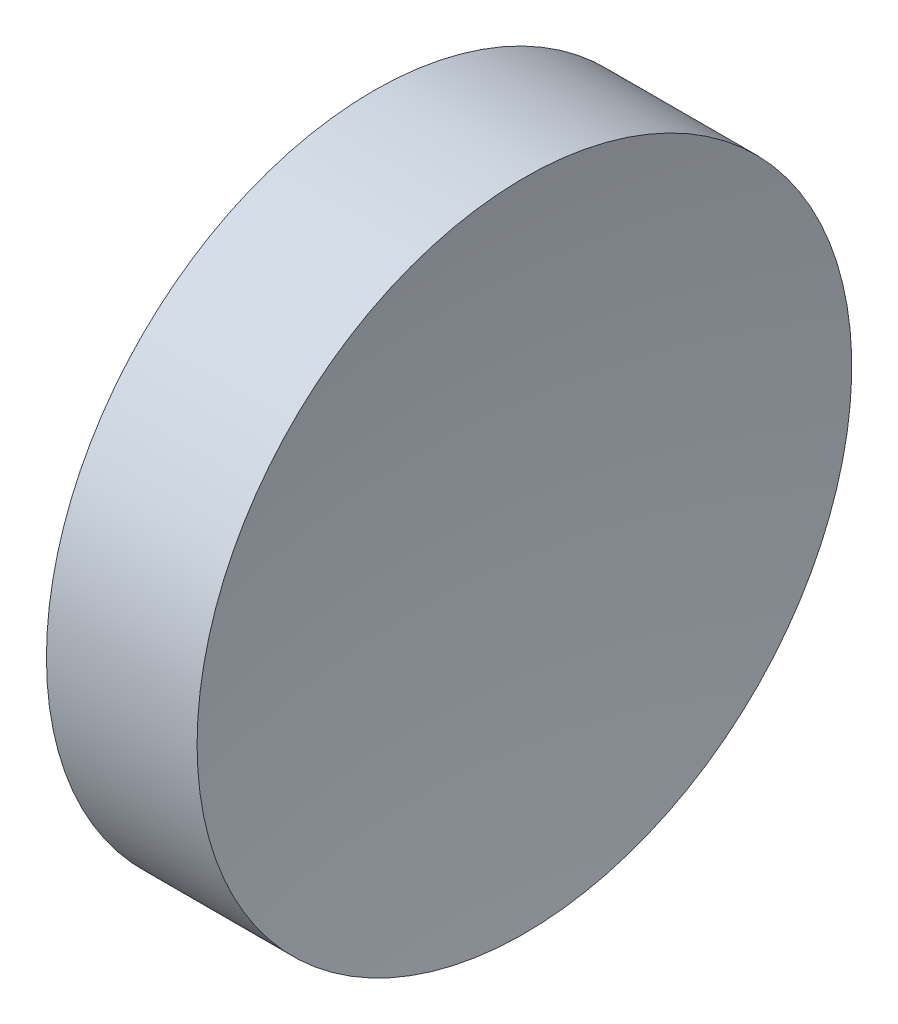
ISO-10303-21;
HEADER;
FILE_DESCRIPTION(('STEP AP214'),'2;1');
FILE_NAME('part.step','',(''),(''),'','','');
FILE_SCHEMA(('AUTOMOTIVE_DESIGN { 1 0 10303 214 1 1 1 1 }'));
ENDSEC;
DATA;
#1=APPLICATION_CONTEXT('core data for automotive mechanical design processes');
#2=APPLICATION_PROTOCOL_DEFINITION('international standard','automotive_design',2000,#1);
#3=PRODUCT_CONTEXT('',#1,'mechanical');
#4=PRODUCT('Part','Part','',(#3));
#5=PRODUCT_RELATED_PRODUCT_CATEGORY('part','',(#4));
#6=PRODUCT_DEFINITION_FORMATION('','',#4);
#7=PRODUCT_DEFINITION_CONTEXT('part definition',#1,'design');
#8=PRODUCT_DEFINITION('design','',#6,#7);
#9=PRODUCT_DEFINITION_SHAPE('','',#8);
#10=(LENGTH_UNIT() NAMED_UNIT(*) SI_UNIT(.MILLI.,.METRE.));
#11=(NAMED_UNIT(*) PLANE_ANGLE_UNIT() SI_UNIT($,.RADIAN.));
#12=(NAMED_UNIT(*) SI_UNIT($,.STERADIAN.) SOLID_ANGLE_UNIT());
#13=UNCERTAINTY_MEASURE_WITH_UNIT(LENGTH_MEASURE(1.E-05),#10,'distance_accuracy_value','');
#14=(GEOMETRIC_REPRESENTATION_CONTEXT(3) GLOBAL_UNCERTAINTY_ASSIGNED_CONTEXT((#13)) GLOBAL_UNIT_ASSIGNED_CONTEXT((#10,
#11,#12)) REPRESENTATION_CONTEXT('',''));
#15=CARTESIAN_POINT('',(0.,0.,0.));
#16=DIRECTION('',(0.,0.,1.));
#17=DIRECTION('',(1.,0.,0.));
#18=AXIS2_PLACEMENT_3D('',#15,#16,#17);
#19=CARTESIAN_POINT('',(48.7527034462293,65.2226028729874,0.));
#20=DIRECTION('',(-1.,0.,0.));
#21=DIRECTION('',(0.,1.,0.));
#22=AXIS2_PLACEMENT_3D('',#19,#20,#21);
#23=SPHERICAL_SURFACE('',#22,69.6);
#24=CARTESIAN_POINT('',(117.18420204154,65.2226028729874,0.));
#25=DIRECTION('',(-1.,0.,0.));
#26=DIRECTION('',(0.,0.,1.));
#27=AXIS2_PLACEMENT_3D('',#24,#25,#26);
#28=CIRCLE('',#27,12.7);
#29=CARTESIAN_POINT('',(117.18420204154,65.2226028729874,12.7));
#30=VERTEX_POINT('',#29);
#31=EDGE_CURVE('E43',#30,#30,#28,.T.);
#32=ORIENTED_EDGE('',*,*,#31,.T.);
#33=EDGE_LOOP('',(#32));
#34=FACE_BOUND('',#33,.T.);
#35=ADVANCED_FACE('F37',(#34),#23,.F.);
#36=CARTESIAN_POINT('',(191.452691592931,65.2226028729874,-0.0406199339281071));
#37=DIRECTION('',(0.,-1.,0.));
#38=DIRECTION('',(0.,0.,1.));
#39=AXIS2_PLACEMENT_3D('',#36,#37,#38);
#40=CIRCLE('',#39,69.6);
#41=TRIMMED_CURVE('',#40,(PARAMETER_VALUE(-1.57021270702142)),
(PARAMETER_VALUE(1.57021270702142)),.T.,.PARAMETER.);
#42=CARTESIAN_POINT('',(191.452691592931,65.2226028729874,0.));
#43=DIRECTION('',(-1.,0.,0.));
#44=AXIS1_PLACEMENT('',#42,#43);
#45=SURFACE_OF_REVOLUTION('',#41,#44);
#46=CARTESIAN_POINT('',(123.02874400366,65.2226028729874,0.));
#47=DIRECTION('',(-1.,0.,0.));
#48=DIRECTION('',(0.,0.,1.));
#49=AXIS2_PLACEMENT_3D('',#46,#47,#48);
#50=CIRCLE('',#49,12.7);
#51=CARTESIAN_POINT('',(123.02874400366,65.2226028729874,12.7));
#52=VERTEX_POINT('',#51);
#53=EDGE_CURVE('E11',#52,#52,#50,.T.);
#54=ORIENTED_EDGE('',*,*,#53,.F.);
#55=EDGE_LOOP('',(#54));
#56=FACE_BOUND('',#55,.T.);
#57=CARTESIAN_POINT('',(121.852703446229,65.2226028729874,0.));
#58=VERTEX_POINT('',#57);
#59=VERTEX_LOOP('',#58);
#60=FACE_BOUND('',#59,.T.);
#61=ADVANCED_FACE('F46',(#56,#60),#45,.F.);
#62=CARTESIAN_POINT('',(109.936935226086,65.2226028729874,0.));
#63=DIRECTION('',(-1.,0.,0.));
#64=DIRECTION('',(0.,0.,1.));
#65=AXIS2_PLACEMENT_3D('',#62,#63,#64);
#66=CYLINDRICAL_SURFACE('',#65,12.7);
#67=ORIENTED_EDGE('',*,*,#31,.F.);
#68=EDGE_LOOP('',(#67));
#69=FACE_BOUND('',#68,.T.);
#70=ORIENTED_EDGE('',*,*,#53,.T.);
#71=EDGE_LOOP('',(#70));
#72=FACE_BOUND('',#71,.T.);
#73=ADVANCED_FACE('F48',(#69,#72),#66,.T.);
#74=CLOSED_SHELL('',(#35,#61,#73));
#75=MANIFOLD_SOLID_BREP('B2',#74);
#76=ADVANCED_BREP_SHAPE_REPRESENTATION('',(#18,#75),#14);
#77=SHAPE_DEFINITION_REPRESENTATION(#9,#76);
ENDSEC;
END-ISO-10303-21;
